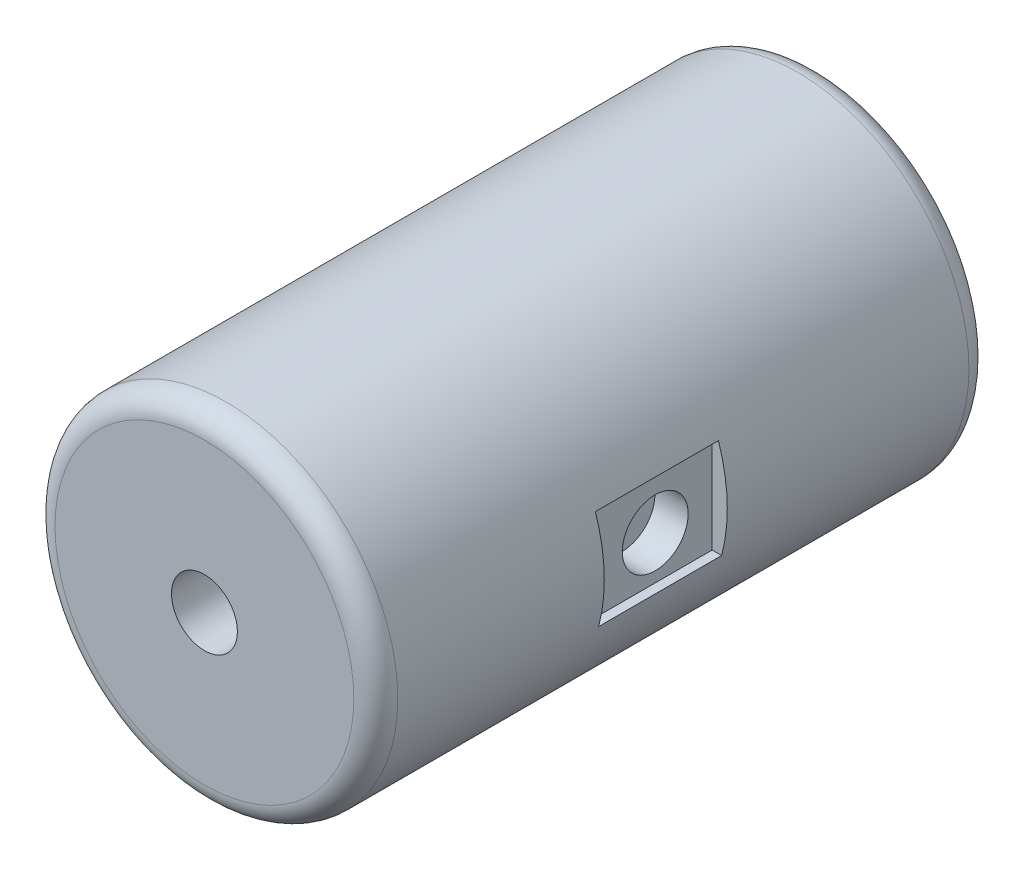
ISO-10303-21;
HEADER;
FILE_DESCRIPTION(('STEP AP214'),'2;1');
FILE_NAME('part.step','',(''),(''),'','','');
FILE_SCHEMA(('AUTOMOTIVE_DESIGN { 1 0 10303 214 1 1 1 1 }'));
ENDSEC;
DATA;
#1=APPLICATION_CONTEXT('core data for automotive mechanical design processes');
#2=APPLICATION_PROTOCOL_DEFINITION('international standard','automotive_design',2000,#1);
#3=PRODUCT_CONTEXT('',#1,'mechanical');
#4=PRODUCT('Part','Part','',(#3));
#5=PRODUCT_RELATED_PRODUCT_CATEGORY('part','',(#4));
#6=PRODUCT_DEFINITION_FORMATION('','',#4);
#7=PRODUCT_DEFINITION_CONTEXT('part definition',#1,'design');
#8=PRODUCT_DEFINITION('design','',#6,#7);
#9=PRODUCT_DEFINITION_SHAPE('','',#8);
#10=(LENGTH_UNIT() NAMED_UNIT(*) SI_UNIT(.MILLI.,.METRE.));
#11=(NAMED_UNIT(*) PLANE_ANGLE_UNIT() SI_UNIT($,.RADIAN.));
#12=(NAMED_UNIT(*) SI_UNIT($,.STERADIAN.) SOLID_ANGLE_UNIT());
#13=UNCERTAINTY_MEASURE_WITH_UNIT(LENGTH_MEASURE(1.E-05),#10,'distance_accuracy_value','');
#14=(GEOMETRIC_REPRESENTATION_CONTEXT(3) GLOBAL_UNCERTAINTY_ASSIGNED_CONTEXT((#13)) GLOBAL_UNIT_ASSIGNED_CONTEXT((#10,
#11,#12)) REPRESENTATION_CONTEXT('',''));
#15=CARTESIAN_POINT('',(0.,0.,0.));
#16=DIRECTION('',(0.,0.,1.));
#17=DIRECTION('',(1.,0.,0.));
#18=AXIS2_PLACEMENT_3D('',#15,#16,#17);
#19=CARTESIAN_POINT('',(0.,0.,14.));
#20=DIRECTION('',(0.,0.,-1.));
#21=DIRECTION('',(-1.,0.,0.));
#22=AXIS2_PLACEMENT_3D('',#19,#20,#21);
#23=CYLINDRICAL_SURFACE('',#22,3.9);
#24=CARTESIAN_POINT('',(0.,0.,8.8));
#25=DIRECTION('',(0.,0.,-1.));
#26=DIRECTION('',(-1.,0.,0.));
#27=AXIS2_PLACEMENT_3D('',#24,#25,#26);
#28=CIRCLE('',#27,3.9);
#29=CARTESIAN_POINT('',(-3.7725514571477,-0.988865766003042,8.8));
#30=VERTEX_POINT('',#29);
#31=CARTESIAN_POINT('',(-3.69791739665169,1.2391153810444,8.8));
#32=VERTEX_POINT('',#31);
#33=EDGE_CURVE('E208',#30,#32,#28,.T.);
#34=ORIENTED_EDGE('',*,*,#33,.F.);
#35=DIRECTION('',(0.,0.,-1.));
#36=VECTOR('',#35,1.);
#37=CARTESIAN_POINT('',(-3.7725514571477,-0.988865766003042,14.));
#38=LINE('',#37,#36);
#39=CARTESIAN_POINT('',(-3.7725514571477,-0.988865766003042,6.));
#40=VERTEX_POINT('',#39);
#41=EDGE_CURVE('E204',#40,#30,#38,.F.);
#42=ORIENTED_EDGE('',*,*,#41,.F.);
#43=CARTESIAN_POINT('',(0.,0.,6.));
#44=DIRECTION('',(0.,0.,-1.));
#45=DIRECTION('',(-1.,0.,0.));
#46=AXIS2_PLACEMENT_3D('',#43,#44,#45);
#47=CIRCLE('',#46,3.9);
#48=CARTESIAN_POINT('',(-3.69791739665169,1.2391153810444,6.));
#49=VERTEX_POINT('',#48);
#50=EDGE_CURVE('E199',#40,#49,#47,.T.);
#51=ORIENTED_EDGE('',*,*,#50,.T.);
#52=DIRECTION('',(0.,0.,-1.));
#53=VECTOR('',#52,1.);
#54=CARTESIAN_POINT('',(-3.69791739665169,1.2391153810444,14.));
#55=LINE('',#54,#53);
#56=EDGE_CURVE('E206',#32,#49,#55,.T.);
#57=ORIENTED_EDGE('',*,*,#56,.F.);
#58=EDGE_LOOP('',(#34,#42,#51,#57));
#59=FACE_BOUND('',#58,.T.);
#60=CARTESIAN_POINT('',(0.,0.,0.5));
#61=DIRECTION('',(0.,0.,1.));
#62=DIRECTION('',(1.,0.,0.));
#63=AXIS2_PLACEMENT_3D('',#60,#61,#62);
#64=CIRCLE('',#63,3.9);
#65=CARTESIAN_POINT('',(3.9,0.,0.5));
#66=VERTEX_POINT('',#65);
#67=EDGE_CURVE('E190',#66,#66,#64,.T.);
#68=ORIENTED_EDGE('',*,*,#67,.T.);
#69=EDGE_LOOP('',(#68));
#70=FACE_BOUND('',#69,.T.);
#71=CARTESIAN_POINT('',(0.,0.,13.5));
#72=DIRECTION('',(0.,0.,1.));
#73=DIRECTION('',(1.,0.,0.));
#74=AXIS2_PLACEMENT_3D('',#71,#72,#73);
#75=CIRCLE('',#74,3.9);
#76=CARTESIAN_POINT('',(3.9,0.,13.5));
#77=VERTEX_POINT('',#76);
#78=EDGE_CURVE('E185',#77,#77,#75,.F.);
#79=ORIENTED_EDGE('',*,*,#78,.T.);
#80=EDGE_LOOP('',(#79));
#81=FACE_BOUND('',#80,.T.);
#82=CARTESIAN_POINT('',(0.,0.,8.8));
#83=DIRECTION('',(0.,0.,-1.));
#84=DIRECTION('',(-1.,0.,0.));
#85=AXIS2_PLACEMENT_3D('',#82,#83,#84);
#86=CIRCLE('',#85,3.9);
#87=CARTESIAN_POINT('',(3.69791739665169,1.2391153810444,8.8));
#88=VERTEX_POINT('',#87);
#89=CARTESIAN_POINT('',(3.7725514571477,-0.988865766003042,8.8));
#90=VERTEX_POINT('',#89);
#91=EDGE_CURVE('E13',#88,#90,#86,.T.);
#92=ORIENTED_EDGE('',*,*,#91,.F.);
#93=DIRECTION('',(0.,0.,-1.));
#94=VECTOR('',#93,1.);
#95=CARTESIAN_POINT('',(3.69791739665169,1.2391153810444,14.));
#96=LINE('',#95,#94);
#97=CARTESIAN_POINT('',(3.69791739665169,1.2391153810444,6.));
#98=VERTEX_POINT('',#97);
#99=EDGE_CURVE('E215',#88,#98,#96,.T.);
#100=ORIENTED_EDGE('',*,*,#99,.T.);
#101=CARTESIAN_POINT('',(0.,0.,6.));
#102=DIRECTION('',(0.,0.,-1.));
#103=DIRECTION('',(-1.,0.,0.));
#104=AXIS2_PLACEMENT_3D('',#101,#102,#103);
#105=CIRCLE('',#104,3.9);
#106=CARTESIAN_POINT('',(3.7725514571477,-0.988865766003042,6.));
#107=VERTEX_POINT('',#106);
#108=EDGE_CURVE('E210',#98,#107,#105,.T.);
#109=ORIENTED_EDGE('',*,*,#108,.T.);
#110=DIRECTION('',(0.,0.,-1.));
#111=VECTOR('',#110,1.);
#112=CARTESIAN_POINT('',(3.7725514571477,-0.988865766003042,14.));
#113=LINE('',#112,#111);
#114=EDGE_CURVE('E56',#107,#90,#113,.F.);
#115=ORIENTED_EDGE('',*,*,#114,.T.);
#116=EDGE_LOOP('',(#92,#100,#109,#115));
#117=FACE_BOUND('',#116,.T.);
#118=ADVANCED_FACE('F48',(#59,#70,#81,#117),#23,.T.);
#119=CARTESIAN_POINT('',(0.,0.,14.));
#120=DIRECTION('',(0.,0.,1.));
#121=DIRECTION('',(1.,0.,0.));
#122=AXIS2_PLACEMENT_3D('',#119,#120,#121);
#123=PLANE('',#122);
#124=CARTESIAN_POINT('',(0.,0.,14.));
#125=DIRECTION('',(0.,0.,1.));
#126=DIRECTION('',(1.,0.,0.));
#127=AXIS2_PLACEMENT_3D('',#124,#125,#126);
#128=CIRCLE('',#127,0.75);
#129=CARTESIAN_POINT('',(0.75,0.,14.));
#130=VERTEX_POINT('',#129);
#131=EDGE_CURVE('E173',#130,#130,#128,.T.);
#132=ORIENTED_EDGE('',*,*,#131,.F.);
#133=EDGE_LOOP('',(#132));
#134=FACE_BOUND('',#133,.T.);
#135=CARTESIAN_POINT('',(0.,0.,14.));
#136=DIRECTION('',(0.,0.,1.));
#137=DIRECTION('',(1.,0.,0.));
#138=AXIS2_PLACEMENT_3D('',#135,#136,#137);
#139=CIRCLE('',#138,3.4);
#140=CARTESIAN_POINT('',(3.4,0.,14.));
#141=VERTEX_POINT('',#140);
#142=EDGE_CURVE('E196',#141,#141,#139,.T.);
#143=ORIENTED_EDGE('',*,*,#142,.T.);
#144=EDGE_LOOP('',(#143));
#145=FACE_BOUND('',#144,.T.);
#146=ADVANCED_FACE('F233',(#134,#145),#123,.T.);
#147=CARTESIAN_POINT('',(0.,0.,0.));
#148=DIRECTION('',(0.,0.,1.));
#149=DIRECTION('',(1.,0.,0.));
#150=AXIS2_PLACEMENT_3D('',#147,#148,#149);
#151=PLANE('',#150);
#152=CARTESIAN_POINT('',(0.,1.5,0.));
#153=DIRECTION('',(0.,0.,-1.));
#154=DIRECTION('',(-1.,0.,0.));
#155=AXIS2_PLACEMENT_3D('',#152,#153,#154);
#156=CIRCLE('',#155,0.75);
#157=CARTESIAN_POINT('',(-0.75,1.5,0.));
#158=VERTEX_POINT('',#157);
#159=EDGE_CURVE('E174',#158,#158,#156,.T.);
#160=ORIENTED_EDGE('',*,*,#159,.F.);
#161=EDGE_LOOP('',(#160));
#162=FACE_BOUND('',#161,.T.);
#163=CARTESIAN_POINT('',(0.,-1.5,0.));
#164=DIRECTION('',(0.,0.,-1.));
#165=DIRECTION('',(-1.,0.,0.));
#166=AXIS2_PLACEMENT_3D('',#163,#164,#165);
#167=CIRCLE('',#166,0.75);
#168=CARTESIAN_POINT('',(-0.75,-1.5,0.));
#169=VERTEX_POINT('',#168);
#170=EDGE_CURVE('E169',#169,#169,#167,.T.);
#171=ORIENTED_EDGE('',*,*,#170,.F.);
#172=EDGE_LOOP('',(#171));
#173=FACE_BOUND('',#172,.T.);
#174=CARTESIAN_POINT('',(0.,0.,0.));
#175=DIRECTION('',(0.,0.,1.));
#176=DIRECTION('',(1.,0.,0.));
#177=AXIS2_PLACEMENT_3D('',#174,#175,#176);
#178=CIRCLE('',#177,3.4);
#179=CARTESIAN_POINT('',(3.4,0.,0.));
#180=VERTEX_POINT('',#179);
#181=EDGE_CURVE('E193',#180,#180,#178,.F.);
#182=ORIENTED_EDGE('',*,*,#181,.T.);
#183=EDGE_LOOP('',(#182));
#184=FACE_BOUND('',#183,.T.);
#185=ADVANCED_FACE('F239',(#162,#173,#184),#151,.F.);
#186=CARTESIAN_POINT('',(0.,0.,0.5));
#187=DIRECTION('',(0.,0.,1.));
#188=DIRECTION('',(1.,0.,0.));
#189=AXIS2_PLACEMENT_3D('',#186,#187,#188);
#190=TOROIDAL_SURFACE('',#189,3.4,0.5);
#191=ORIENTED_EDGE('',*,*,#181,.F.);
#192=EDGE_LOOP('',(#191));
#193=FACE_BOUND('',#192,.T.);
#194=ORIENTED_EDGE('',*,*,#67,.F.);
#195=EDGE_LOOP('',(#194));
#196=FACE_BOUND('',#195,.T.);
#197=ADVANCED_FACE('F245',(#193,#196),#190,.T.);
#198=CARTESIAN_POINT('',(0.,0.,13.5));
#199=DIRECTION('',(0.,0.,1.));
#200=DIRECTION('',(1.,0.,0.));
#201=AXIS2_PLACEMENT_3D('',#198,#199,#200);
#202=TOROIDAL_SURFACE('',#201,3.4,0.5);
#203=ORIENTED_EDGE('',*,*,#78,.F.);
#204=EDGE_LOOP('',(#203));
#205=FACE_BOUND('',#204,.T.);
#206=ORIENTED_EDGE('',*,*,#142,.F.);
#207=EDGE_LOOP('',(#206));
#208=FACE_BOUND('',#207,.T.);
#209=ADVANCED_FACE('F50',(#205,#208),#202,.T.);
#210=CARTESIAN_POINT('',(0.,0.,9.));
#211=DIRECTION('',(0.,0.,1.));
#212=DIRECTION('',(1.,0.,0.));
#213=AXIS2_PLACEMENT_3D('',#210,#211,#212);
#214=CYLINDRICAL_SURFACE('',#213,0.75);
#215=CARTESIAN_POINT('',(0.,0.,9.));
#216=DIRECTION('',(0.,0.,1.));
#217=DIRECTION('',(1.,0.,0.));
#218=AXIS2_PLACEMENT_3D('',#215,#216,#217);
#219=CIRCLE('',#218,0.75);
#220=CARTESIAN_POINT('',(0.75,0.,9.));
#221=VERTEX_POINT('',#220);
#222=EDGE_CURVE('E182',#221,#221,#219,.T.);
#223=ORIENTED_EDGE('',*,*,#222,.F.);
#224=EDGE_LOOP('',(#223));
#225=FACE_BOUND('',#224,.T.);
#226=ORIENTED_EDGE('',*,*,#131,.T.);
#227=EDGE_LOOP('',(#226));
#228=FACE_BOUND('',#227,.T.);
#229=ADVANCED_FACE('F252',(#225,#228),#214,.F.);
#230=CARTESIAN_POINT('',(0.,0.,9.));
#231=DIRECTION('',(0.,0.,1.));
#232=DIRECTION('',(1.,0.,0.));
#233=AXIS2_PLACEMENT_3D('',#230,#231,#232);
#234=PLANE('',#233);
#235=ORIENTED_EDGE('',*,*,#222,.T.);
#236=EDGE_LOOP('',(#235));
#237=FACE_BOUND('',#236,.T.);
#238=ADVANCED_FACE('F273',(#237),#234,.T.);
#239=CARTESIAN_POINT('',(0.,-1.5,5.));
#240=DIRECTION('',(0.,0.,-1.));
#241=DIRECTION('',(-1.,0.,0.));
#242=AXIS2_PLACEMENT_3D('',#239,#240,#241);
#243=CYLINDRICAL_SURFACE('',#242,0.75);
#244=CARTESIAN_POINT('',(0.,-1.5,5.));
#245=DIRECTION('',(0.,0.,-1.));
#246=DIRECTION('',(-1.,0.,0.));
#247=AXIS2_PLACEMENT_3D('',#244,#245,#246);
#248=CIRCLE('',#247,0.75);
#249=CARTESIAN_POINT('',(-0.75,-1.5,5.));
#250=VERTEX_POINT('',#249);
#251=EDGE_CURVE('E177',#250,#250,#248,.T.);
#252=ORIENTED_EDGE('',*,*,#251,.F.);
#253=EDGE_LOOP('',(#252));
#254=FACE_BOUND('',#253,.T.);
#255=ORIENTED_EDGE('',*,*,#170,.T.);
#256=EDGE_LOOP('',(#255));
#257=FACE_BOUND('',#256,.T.);
#258=ADVANCED_FACE('F270',(#254,#257),#243,.F.);
#259=CARTESIAN_POINT('',(0.,-1.5,5.));
#260=DIRECTION('',(0.,0.,-1.));
#261=DIRECTION('',(-1.,0.,0.));
#262=AXIS2_PLACEMENT_3D('',#259,#260,#261);
#263=PLANE('',#262);
#264=ORIENTED_EDGE('',*,*,#251,.T.);
#265=EDGE_LOOP('',(#264));
#266=FACE_BOUND('',#265,.T.);
#267=ADVANCED_FACE('F272',(#266),#263,.T.);
#268=CARTESIAN_POINT('',(0.,1.5,5.));
#269=DIRECTION('',(0.,0.,-1.));
#270=DIRECTION('',(-1.,0.,0.));
#271=AXIS2_PLACEMENT_3D('',#268,#269,#270);
#272=CYLINDRICAL_SURFACE('',#271,0.75);
#273=CARTESIAN_POINT('',(0.,1.5,5.));
#274=DIRECTION('',(0.,0.,-1.));
#275=DIRECTION('',(-1.,0.,0.));
#276=AXIS2_PLACEMENT_3D('',#273,#274,#275);
#277=CIRCLE('',#276,0.75);
#278=CARTESIAN_POINT('',(-0.75,1.5,5.));
#279=VERTEX_POINT('',#278);
#280=EDGE_CURVE('E170',#279,#279,#277,.T.);
#281=ORIENTED_EDGE('',*,*,#280,.F.);
#282=EDGE_LOOP('',(#281));
#283=FACE_BOUND('',#282,.T.);
#284=ORIENTED_EDGE('',*,*,#159,.T.);
#285=EDGE_LOOP('',(#284));
#286=FACE_BOUND('',#285,.T.);
#287=ADVANCED_FACE('F280',(#283,#286),#272,.F.);
#288=CARTESIAN_POINT('',(0.,1.5,5.));
#289=DIRECTION('',(0.,0.,-1.));
#290=DIRECTION('',(-1.,0.,0.));
#291=AXIS2_PLACEMENT_3D('',#288,#289,#290);
#292=PLANE('',#291);
#293=ORIENTED_EDGE('',*,*,#280,.T.);
#294=EDGE_LOOP('',(#293));
#295=FACE_BOUND('',#294,.T.);
#296=ADVANCED_FACE('F327',(#295),#292,.T.);
#297=CARTESIAN_POINT('',(-3.55662374501129,1.2391153810444,8.8));
#298=DIRECTION('',(0.,-1.,0.));
#299=DIRECTION('',(0.,0.,-1.));
#300=AXIS2_PLACEMENT_3D('',#297,#298,#299);
#301=PLANE('',#300);
#302=ORIENTED_EDGE('',*,*,#56,.T.);
#303=DIRECTION('',(-1.,0.,0.));
#304=VECTOR('',#303,1.);
#305=CARTESIAN_POINT('',(-3.55662374501129,1.2391153810444,6.));
#306=LINE('',#305,#304);
#307=CARTESIAN_POINT('',(-3.55662374501129,1.2391153810444,6.));
#308=VERTEX_POINT('',#307);
#309=EDGE_CURVE('E71',#308,#49,#306,.T.);
#310=ORIENTED_EDGE('',*,*,#309,.F.);
#311=DIRECTION('',(0.,0.,-1.));
#312=VECTOR('',#311,1.);
#313=CARTESIAN_POINT('',(-3.55662374501129,1.2391153810444,8.8));
#314=LINE('',#313,#312);
#315=CARTESIAN_POINT('',(-3.55662374501129,1.2391153810444,8.8));
#316=VERTEX_POINT('',#315);
#317=EDGE_CURVE('E162',#316,#308,#314,.T.);
#318=ORIENTED_EDGE('',*,*,#317,.F.);
#319=DIRECTION('',(-1.,0.,0.));
#320=VECTOR('',#319,1.);
#321=CARTESIAN_POINT('',(-3.55662374501129,1.2391153810444,8.8));
#322=LINE('',#321,#320);
#323=EDGE_CURVE('E150',#316,#32,#322,.T.);
#324=ORIENTED_EDGE('',*,*,#323,.T.);
#325=EDGE_LOOP('',(#302,#310,#318,#324));
#326=FACE_BOUND('',#325,.T.);
#327=ADVANCED_FACE('F336',(#326),#301,.T.);
#328=CARTESIAN_POINT('',(-3.55662374501129,-0.988865766003042,8.8));
#329=DIRECTION('',(0.,1.,0.));
#330=DIRECTION('',(0.,0.,1.));
#331=AXIS2_PLACEMENT_3D('',#328,#329,#330);
#332=PLANE('',#331);
#333=ORIENTED_EDGE('',*,*,#41,.T.);
#334=DIRECTION('',(1.,0.,0.));
#335=VECTOR('',#334,1.);
#336=CARTESIAN_POINT('',(-3.55662374501129,-0.988865766003042,8.8));
#337=LINE('',#336,#335);
#338=CARTESIAN_POINT('',(-3.55662374501129,-0.988865766003042,8.8));
#339=VERTEX_POINT('',#338);
#340=EDGE_CURVE('E154',#30,#339,#337,.T.);
#341=ORIENTED_EDGE('',*,*,#340,.T.);
#342=DIRECTION('',(0.,0.,-1.));
#343=VECTOR('',#342,1.);
#344=CARTESIAN_POINT('',(-3.55662374501129,-0.988865766003042,8.8));
#345=LINE('',#344,#343);
#346=CARTESIAN_POINT('',(-3.55662374501129,-0.988865766003042,6.));
#347=VERTEX_POINT('',#346);
#348=EDGE_CURVE('E156',#339,#347,#345,.T.);
#349=ORIENTED_EDGE('',*,*,#348,.T.);
#350=DIRECTION('',(1.,0.,0.));
#351=VECTOR('',#350,1.);
#352=CARTESIAN_POINT('',(-3.55662374501129,-0.988865766003042,6.));
#353=LINE('',#352,#351);
#354=EDGE_CURVE('E151',#40,#347,#353,.T.);
#355=ORIENTED_EDGE('',*,*,#354,.F.);
#356=EDGE_LOOP('',(#333,#341,#349,#355));
#357=FACE_BOUND('',#356,.T.);
#358=ADVANCED_FACE('F360',(#357),#332,.T.);
#359=CARTESIAN_POINT('',(0.,0.,8.8));
#360=DIRECTION('',(0.,0.,-1.));
#361=DIRECTION('',(-1.,0.,0.));
#362=AXIS2_PLACEMENT_3D('',#359,#360,#361);
#363=PLANE('',#362);
#364=ORIENTED_EDGE('',*,*,#33,.T.);
#365=ORIENTED_EDGE('',*,*,#323,.F.);
#366=DIRECTION('',(0.,1.,0.));
#367=VECTOR('',#366,1.);
#368=CARTESIAN_POINT('',(-3.55662374501129,1.2391153810444,8.8));
#369=LINE('',#368,#367);
#370=EDGE_CURVE('E147',#339,#316,#369,.T.);
#371=ORIENTED_EDGE('',*,*,#370,.F.);
#372=ORIENTED_EDGE('',*,*,#340,.F.);
#373=EDGE_LOOP('',(#364,#365,#371,#372));
#374=FACE_BOUND('',#373,.T.);
#375=ADVANCED_FACE('F370',(#374),#363,.T.);
#376=CARTESIAN_POINT('',(0.,0.,6.));
#377=DIRECTION('',(0.,0.,-1.));
#378=DIRECTION('',(-1.,0.,0.));
#379=AXIS2_PLACEMENT_3D('',#376,#377,#378);
#380=PLANE('',#379);
#381=ORIENTED_EDGE('',*,*,#354,.T.);
#382=DIRECTION('',(0.,1.,0.));
#383=VECTOR('',#382,1.);
#384=CARTESIAN_POINT('',(-3.55662374501129,1.2391153810444,6.));
#385=LINE('',#384,#383);
#386=EDGE_CURVE('E146',#347,#308,#385,.T.);
#387=ORIENTED_EDGE('',*,*,#386,.T.);
#388=ORIENTED_EDGE('',*,*,#309,.T.);
#389=ORIENTED_EDGE('',*,*,#50,.F.);
#390=EDGE_LOOP('',(#381,#387,#388,#389));
#391=FACE_BOUND('',#390,.T.);
#392=ADVANCED_FACE('F380',(#391),#380,.F.);
#393=CARTESIAN_POINT('',(-3.55662374501129,1.2391153810444,8.8));
#394=DIRECTION('',(-1.,0.,0.));
#395=DIRECTION('',(0.,0.,1.));
#396=AXIS2_PLACEMENT_3D('',#393,#394,#395);
#397=PLANE('',#396);
#398=ORIENTED_EDGE('',*,*,#386,.F.);
#399=ORIENTED_EDGE('',*,*,#348,.F.);
#400=ORIENTED_EDGE('',*,*,#370,.T.);
#401=ORIENTED_EDGE('',*,*,#317,.T.);
#402=EDGE_LOOP('',(#398,#399,#400,#401));
#403=FACE_BOUND('',#402,.T.);
#404=CARTESIAN_POINT('',(-3.55662374501129,0.,7.29721763294633));
#405=DIRECTION('',(-1.,0.,0.));
#406=DIRECTION('',(0.,0.,1.));
#407=AXIS2_PLACEMENT_3D('',#404,#405,#406);
#408=CIRCLE('',#407,0.75);
#409=CARTESIAN_POINT('',(-3.55662374501129,0.,8.04721763294633));
#410=VERTEX_POINT('',#409);
#411=EDGE_CURVE('E165',#410,#410,#408,.F.);
#412=ORIENTED_EDGE('',*,*,#411,.T.);
#413=EDGE_LOOP('',(#412));
#414=FACE_BOUND('',#413,.T.);
#415=ADVANCED_FACE('F348',(#403,#414),#397,.T.);
#416=CARTESIAN_POINT('',(-2.8,0.,7.29721763294633));
#417=DIRECTION('',(1.,0.,0.));
#418=DIRECTION('',(0.,0.,-1.));
#419=AXIS2_PLACEMENT_3D('',#416,#417,#418);
#420=PLANE('',#419);
#421=CARTESIAN_POINT('',(-2.8,0.,7.29721763294633));
#422=DIRECTION('',(1.,0.,0.));
#423=DIRECTION('',(0.,0.,-1.));
#424=AXIS2_PLACEMENT_3D('',#421,#422,#423);
#425=CIRCLE('',#424,0.75);
#426=CARTESIAN_POINT('',(-2.8,0.,6.54721763294632));
#427=VERTEX_POINT('',#426);
#428=EDGE_CURVE('E166',#427,#427,#425,.T.);
#429=ORIENTED_EDGE('',*,*,#428,.F.);
#430=EDGE_LOOP('',(#429));
#431=FACE_BOUND('',#430,.T.);
#432=ADVANCED_FACE('F344',(#431),#420,.F.);
#433=CARTESIAN_POINT('',(-4.8,0.,7.29721763294633));
#434=DIRECTION('',(1.,0.,0.));
#435=DIRECTION('',(0.,0.,-1.));
#436=AXIS2_PLACEMENT_3D('',#433,#434,#435);
#437=CYLINDRICAL_SURFACE('',#436,0.75);
#438=ORIENTED_EDGE('',*,*,#428,.T.);
#439=EDGE_LOOP('',(#438));
#440=FACE_BOUND('',#439,.T.);
#441=ORIENTED_EDGE('',*,*,#411,.F.);
#442=EDGE_LOOP('',(#441));
#443=FACE_BOUND('',#442,.T.);
#444=ADVANCED_FACE('F229',(#440,#443),#437,.F.);
#445=CARTESIAN_POINT('',(3.55662374501129,-0.988865766003042,8.8));
#446=DIRECTION('',(0.,-1.,0.));
#447=DIRECTION('',(0.,0.,-1.));
#448=AXIS2_PLACEMENT_3D('',#445,#446,#447);
#449=PLANE('',#448);
#450=DIRECTION('',(-1.,0.,0.));
#451=VECTOR('',#450,1.);
#452=CARTESIAN_POINT('',(3.55662374501129,-0.988865766003042,6.));
#453=LINE('',#452,#451);
#454=CARTESIAN_POINT('',(3.55662374501129,-0.988865766003042,6.));
#455=VERTEX_POINT('',#454);
#456=EDGE_CURVE('E63',#107,#455,#453,.T.);
#457=ORIENTED_EDGE('',*,*,#456,.T.);
#458=DIRECTION('',(0.,0.,-1.));
#459=VECTOR('',#458,1.);
#460=CARTESIAN_POINT('',(3.55662374501129,-0.988865766003042,8.8));
#461=LINE('',#460,#459);
#462=CARTESIAN_POINT('',(3.55662374501129,-0.988865766003042,8.8));
#463=VERTEX_POINT('',#462);
#464=EDGE_CURVE('E125',#463,#455,#461,.T.);
#465=ORIENTED_EDGE('',*,*,#464,.F.);
#466=DIRECTION('',(-1.,0.,0.));
#467=VECTOR('',#466,1.);
#468=CARTESIAN_POINT('',(3.55662374501129,-0.988865766003042,8.8));
#469=LINE('',#468,#467);
#470=EDGE_CURVE('E112',#90,#463,#469,.T.);
#471=ORIENTED_EDGE('',*,*,#470,.F.);
#472=ORIENTED_EDGE('',*,*,#114,.F.);
#473=EDGE_LOOP('',(#457,#465,#471,#472));
#474=FACE_BOUND('',#473,.T.);
#475=ADVANCED_FACE('F126',(#474),#449,.F.);
#476=CARTESIAN_POINT('',(3.55662374501129,1.2391153810444,8.8));
#477=DIRECTION('',(0.,1.,0.));
#478=DIRECTION('',(0.,0.,1.));
#479=AXIS2_PLACEMENT_3D('',#476,#477,#478);
#480=PLANE('',#479);
#481=DIRECTION('',(1.,0.,0.));
#482=VECTOR('',#481,1.);
#483=CARTESIAN_POINT('',(3.55662374501129,1.2391153810444,8.8));
#484=LINE('',#483,#482);
#485=CARTESIAN_POINT('',(3.55662374501129,1.2391153810444,8.8));
#486=VERTEX_POINT('',#485);
#487=EDGE_CURVE('E122',#486,#88,#484,.T.);
#488=ORIENTED_EDGE('',*,*,#487,.F.);
#489=DIRECTION('',(0.,0.,-1.));
#490=VECTOR('',#489,1.);
#491=CARTESIAN_POINT('',(3.55662374501129,1.2391153810444,8.8));
#492=LINE('',#491,#490);
#493=CARTESIAN_POINT('',(3.55662374501129,1.2391153810444,6.));
#494=VERTEX_POINT('',#493);
#495=EDGE_CURVE('E130',#486,#494,#492,.T.);
#496=ORIENTED_EDGE('',*,*,#495,.T.);
#497=DIRECTION('',(1.,0.,0.));
#498=VECTOR('',#497,1.);
#499=CARTESIAN_POINT('',(3.55662374501129,1.2391153810444,6.));
#500=LINE('',#499,#498);
#501=EDGE_CURVE('E133',#494,#98,#500,.T.);
#502=ORIENTED_EDGE('',*,*,#501,.T.);
#503=ORIENTED_EDGE('',*,*,#99,.F.);
#504=EDGE_LOOP('',(#488,#496,#502,#503));
#505=FACE_BOUND('',#504,.T.);
#506=ADVANCED_FACE('F221',(#505),#480,.F.);
#507=CARTESIAN_POINT('',(0.,0.,8.8));
#508=DIRECTION('',(0.,0.,-1.));
#509=DIRECTION('',(1.,0.,0.));
#510=AXIS2_PLACEMENT_3D('',#507,#508,#509);
#511=PLANE('',#510);
#512=ORIENTED_EDGE('',*,*,#91,.T.);
#513=ORIENTED_EDGE('',*,*,#470,.T.);
#514=DIRECTION('',(0.,1.,0.));
#515=VECTOR('',#514,1.);
#516=CARTESIAN_POINT('',(3.55662374501129,1.2391153810444,8.8));
#517=LINE('',#516,#515);
#518=EDGE_CURVE('E117',#463,#486,#517,.T.);
#519=ORIENTED_EDGE('',*,*,#518,.T.);
#520=ORIENTED_EDGE('',*,*,#487,.T.);
#521=EDGE_LOOP('',(#512,#513,#519,#520));
#522=FACE_BOUND('',#521,.T.);
#523=ADVANCED_FACE('F114',(#522),#511,.T.);
#524=CARTESIAN_POINT('',(0.,0.,6.));
#525=DIRECTION('',(0.,0.,-1.));
#526=DIRECTION('',(1.,0.,0.));
#527=AXIS2_PLACEMENT_3D('',#524,#525,#526);
#528=PLANE('',#527);
#529=ORIENTED_EDGE('',*,*,#501,.F.);
#530=DIRECTION('',(0.,1.,0.));
#531=VECTOR('',#530,1.);
#532=CARTESIAN_POINT('',(3.55662374501129,1.2391153810444,6.));
#533=LINE('',#532,#531);
#534=EDGE_CURVE('E139',#455,#494,#533,.T.);
#535=ORIENTED_EDGE('',*,*,#534,.F.);
#536=ORIENTED_EDGE('',*,*,#456,.F.);
#537=ORIENTED_EDGE('',*,*,#108,.F.);
#538=EDGE_LOOP('',(#529,#535,#536,#537));
#539=FACE_BOUND('',#538,.T.);
#540=ADVANCED_FACE('F219',(#539),#528,.F.);
#541=CARTESIAN_POINT('',(3.55662374501129,1.2391153810444,8.8));
#542=DIRECTION('',(-1.,0.,0.));
#543=DIRECTION('',(0.,0.,1.));
#544=AXIS2_PLACEMENT_3D('',#541,#542,#543);
#545=PLANE('',#544);
#546=CARTESIAN_POINT('',(3.55662374501129,0.,7.29721763294633));
#547=DIRECTION('',(-1.,0.,0.));
#548=DIRECTION('',(0.,0.,1.));
#549=AXIS2_PLACEMENT_3D('',#546,#547,#548);
#550=CIRCLE('',#549,0.75);
#551=CARTESIAN_POINT('',(3.55662374501129,0.,8.04721763294633));
#552=VERTEX_POINT('',#551);
#553=EDGE_CURVE('E129',#552,#552,#550,.T.);
#554=ORIENTED_EDGE('',*,*,#553,.T.);
#555=EDGE_LOOP('',(#554));
#556=FACE_BOUND('',#555,.T.);
#557=ORIENTED_EDGE('',*,*,#534,.T.);
#558=ORIENTED_EDGE('',*,*,#495,.F.);
#559=ORIENTED_EDGE('',*,*,#518,.F.);
#560=ORIENTED_EDGE('',*,*,#464,.T.);
#561=EDGE_LOOP('',(#557,#558,#559,#560));
#562=FACE_BOUND('',#561,.T.);
#563=ADVANCED_FACE('F132',(#556,#562),#545,.F.);
#564=CARTESIAN_POINT('',(2.8,0.,7.29721763294633));
#565=DIRECTION('',(-1.,0.,0.));
#566=DIRECTION('',(0.,0.,-1.));
#567=AXIS2_PLACEMENT_3D('',#564,#565,#566);
#568=PLANE('',#567);
#569=CARTESIAN_POINT('',(2.8,0.,7.29721763294633));
#570=DIRECTION('',(1.,0.,0.));
#571=DIRECTION('',(0.,0.,-1.));
#572=AXIS2_PLACEMENT_3D('',#569,#570,#571);
#573=CIRCLE('',#572,0.75);
#574=CARTESIAN_POINT('',(2.8,0.,6.54721763294632));
#575=VERTEX_POINT('',#574);
#576=EDGE_CURVE('E143',#575,#575,#573,.T.);
#577=ORIENTED_EDGE('',*,*,#576,.T.);
#578=EDGE_LOOP('',(#577));
#579=FACE_BOUND('',#578,.T.);
#580=ADVANCED_FACE('F442',(#579),#568,.F.);
#581=CARTESIAN_POINT('',(4.8,0.,7.29721763294633));
#582=DIRECTION('',(-1.,0.,0.));
#583=DIRECTION('',(0.,0.,1.));
#584=AXIS2_PLACEMENT_3D('',#581,#582,#583);
#585=CYLINDRICAL_SURFACE('',#584,0.75);
#586=ORIENTED_EDGE('',*,*,#553,.F.);
#587=EDGE_LOOP('',(#586));
#588=FACE_BOUND('',#587,.T.);
#589=ORIENTED_EDGE('',*,*,#576,.F.);
#590=EDGE_LOOP('',(#589));
#591=FACE_BOUND('',#590,.T.);
#592=ADVANCED_FACE('F451',(#588,#591),#585,.F.);
#593=CLOSED_SHELL('',(#118,#146,#185,#197,#209,#229,#238,#258,#267,#287,#296,#327,#358,#375,
#392,#415,#432,#444,#475,#506,#523,#540,#563,#580,#592));
#594=MANIFOLD_SOLID_BREP('B2',#593);
#595=ADVANCED_BREP_SHAPE_REPRESENTATION('',(#18,#594),#14);
#596=SHAPE_DEFINITION_REPRESENTATION(#9,#595);
ENDSEC;
END-ISO-10303-21;
